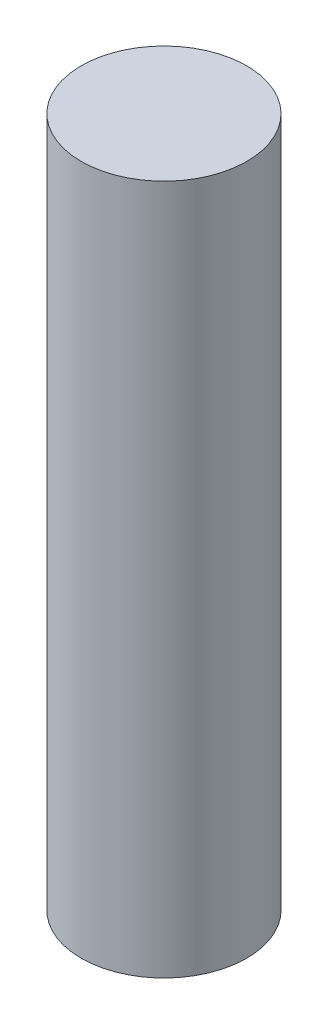
ISO-10303-21;
HEADER;
FILE_DESCRIPTION(('STEP AP214'),'2;1');
FILE_NAME('part.step','',(''),(''),'','','');
FILE_SCHEMA(('AUTOMOTIVE_DESIGN { 1 0 10303 214 1 1 1 1 }'));
ENDSEC;
DATA;
#1=APPLICATION_CONTEXT('core data for automotive mechanical design processes');
#2=APPLICATION_PROTOCOL_DEFINITION('international standard','automotive_design',2000,#1);
#3=PRODUCT_CONTEXT('',#1,'mechanical');
#4=PRODUCT('Part','Part','',(#3));
#5=PRODUCT_RELATED_PRODUCT_CATEGORY('part','',(#4));
#6=PRODUCT_DEFINITION_FORMATION('','',#4);
#7=PRODUCT_DEFINITION_CONTEXT('part definition',#1,'design');
#8=PRODUCT_DEFINITION('design','',#6,#7);
#9=PRODUCT_DEFINITION_SHAPE('','',#8);
#10=(LENGTH_UNIT() NAMED_UNIT(*) SI_UNIT(.MILLI.,.METRE.));
#11=(NAMED_UNIT(*) PLANE_ANGLE_UNIT() SI_UNIT($,.RADIAN.));
#12=(NAMED_UNIT(*) SI_UNIT($,.STERADIAN.) SOLID_ANGLE_UNIT());
#13=UNCERTAINTY_MEASURE_WITH_UNIT(LENGTH_MEASURE(1.E-05),#10,'distance_accuracy_value','');
#14=(GEOMETRIC_REPRESENTATION_CONTEXT(3) GLOBAL_UNCERTAINTY_ASSIGNED_CONTEXT((#13)) GLOBAL_UNIT_ASSIGNED_CONTEXT((#10,
#11,#12)) REPRESENTATION_CONTEXT('',''));
#15=CARTESIAN_POINT('',(0.,0.,0.));
#16=DIRECTION('',(0.,0.,1.));
#17=DIRECTION('',(1.,0.,0.));
#18=AXIS2_PLACEMENT_3D('',#15,#16,#17);
#19=CARTESIAN_POINT('',(0.,12.5,0.));
#20=DIRECTION('',(0.,-1.,0.));
#21=DIRECTION('',(0.,0.,-1.));
#22=AXIS2_PLACEMENT_3D('',#19,#20,#21);
#23=CYLINDRICAL_SURFACE('',#22,1.5);
#24=CARTESIAN_POINT('',(0.,12.5,0.));
#25=DIRECTION('',(0.,1.,0.));
#26=DIRECTION('',(0.,0.,1.));
#27=AXIS2_PLACEMENT_3D('',#24,#25,#26);
#28=CIRCLE('',#27,1.5);
#29=CARTESIAN_POINT('',(0.,12.5,1.5));
#30=VERTEX_POINT('',#29);
#31=EDGE_CURVE('E10',#30,#30,#28,.T.);
#32=ORIENTED_EDGE('',*,*,#31,.F.);
#33=EDGE_LOOP('',(#32));
#34=FACE_BOUND('',#33,.T.);
#35=CARTESIAN_POINT('',(0.,0.,0.));
#36=DIRECTION('',(0.,1.,0.));
#37=DIRECTION('',(0.,0.,1.));
#38=AXIS2_PLACEMENT_3D('',#35,#36,#37);
#39=CIRCLE('',#38,1.5);
#40=CARTESIAN_POINT('',(0.,0.,1.5));
#41=VERTEX_POINT('',#40);
#42=EDGE_CURVE('E34',#41,#41,#39,.T.);
#43=ORIENTED_EDGE('',*,*,#42,.T.);
#44=EDGE_LOOP('',(#43));
#45=FACE_BOUND('',#44,.T.);
#46=ADVANCED_FACE('F31',(#34,#45),#23,.T.);
#47=CARTESIAN_POINT('',(0.,12.5,0.));
#48=DIRECTION('',(0.,1.,0.));
#49=DIRECTION('',(0.,0.,1.));
#50=AXIS2_PLACEMENT_3D('',#47,#48,#49);
#51=PLANE('',#50);
#52=ORIENTED_EDGE('',*,*,#31,.T.);
#53=EDGE_LOOP('',(#52));
#54=FACE_BOUND('',#53,.T.);
#55=ADVANCED_FACE('F46',(#54),#51,.T.);
#56=CARTESIAN_POINT('',(0.,0.,0.));
#57=DIRECTION('',(0.,1.,0.));
#58=DIRECTION('',(0.,0.,1.));
#59=AXIS2_PLACEMENT_3D('',#56,#57,#58);
#60=PLANE('',#59);
#61=ORIENTED_EDGE('',*,*,#42,.F.);
#62=EDGE_LOOP('',(#61));
#63=FACE_BOUND('',#62,.T.);
#64=ADVANCED_FACE('F44',(#63),#60,.F.);
#65=CLOSED_SHELL('',(#46,#55,#64));
#66=MANIFOLD_SOLID_BREP('B2',#65);
#67=ADVANCED_BREP_SHAPE_REPRESENTATION('',(#18,#66),#14);
#68=SHAPE_DEFINITION_REPRESENTATION(#9,#67);
ENDSEC;
END-ISO-10303-21;
